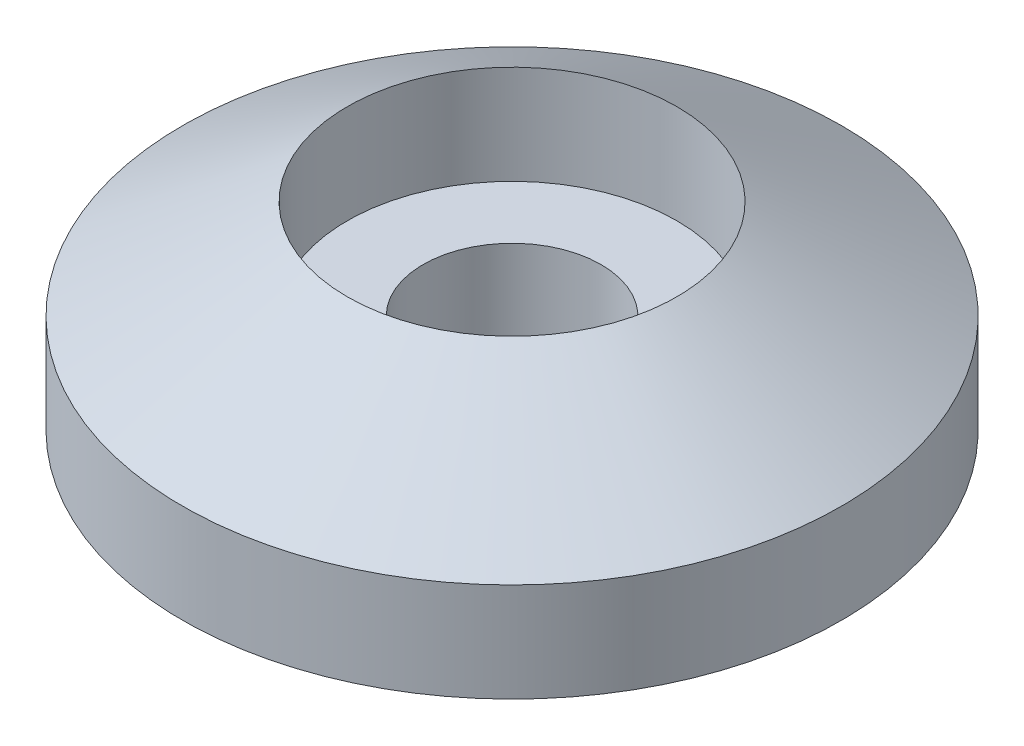
ISO-10303-21;
HEADER;
FILE_DESCRIPTION(('STEP AP214'),'2;1');
FILE_NAME('part.step','',(''),(''),'','','');
FILE_SCHEMA(('AUTOMOTIVE_DESIGN { 1 0 10303 214 1 1 1 1 }'));
ENDSEC;
DATA;
#1=APPLICATION_CONTEXT('core data for automotive mechanical design processes');
#2=APPLICATION_PROTOCOL_DEFINITION('international standard','automotive_design',2000,#1);
#3=PRODUCT_CONTEXT('',#1,'mechanical');
#4=PRODUCT('Part','Part','',(#3));
#5=PRODUCT_RELATED_PRODUCT_CATEGORY('part','',(#4));
#6=PRODUCT_DEFINITION_FORMATION('','',#4);
#7=PRODUCT_DEFINITION_CONTEXT('part definition',#1,'design');
#8=PRODUCT_DEFINITION('design','',#6,#7);
#9=PRODUCT_DEFINITION_SHAPE('','',#8);
#10=(LENGTH_UNIT() NAMED_UNIT(*) SI_UNIT(.MILLI.,.METRE.));
#11=(NAMED_UNIT(*) PLANE_ANGLE_UNIT() SI_UNIT($,.RADIAN.));
#12=(NAMED_UNIT(*) SI_UNIT($,.STERADIAN.) SOLID_ANGLE_UNIT());
#13=UNCERTAINTY_MEASURE_WITH_UNIT(LENGTH_MEASURE(1.E-05),#10,'distance_accuracy_value','');
#14=(GEOMETRIC_REPRESENTATION_CONTEXT(3) GLOBAL_UNCERTAINTY_ASSIGNED_CONTEXT((#13)) GLOBAL_UNIT_ASSIGNED_CONTEXT((#10,
#11,#12)) REPRESENTATION_CONTEXT('',''));
#15=CARTESIAN_POINT('',(0.,0.,0.));
#16=DIRECTION('',(0.,0.,1.));
#17=DIRECTION('',(1.,0.,0.));
#18=AXIS2_PLACEMENT_3D('',#15,#16,#17);
#19=CARTESIAN_POINT('',(0.,0.,0.));
#20=DIRECTION('',(0.,-1.,0.));
#21=DIRECTION('',(0.,0.,-1.));
#22=AXIS2_PLACEMENT_3D('',#19,#20,#21);
#23=CYLINDRICAL_SURFACE('',#22,2.7);
#24=CARTESIAN_POINT('',(0.,3.,0.));
#25=DIRECTION('',(0.,-1.,0.));
#26=DIRECTION('',(0.,0.,-1.));
#27=AXIS2_PLACEMENT_3D('',#24,#25,#26);
#28=CIRCLE('',#27,2.7);
#29=CARTESIAN_POINT('',(0.,3.,-2.7));
#30=VERTEX_POINT('',#29);
#31=EDGE_CURVE('E10',#30,#30,#28,.T.);
#32=ORIENTED_EDGE('',*,*,#31,.F.);
#33=EDGE_LOOP('',(#32));
#34=FACE_BOUND('',#33,.T.);
#35=CARTESIAN_POINT('',(0.,0.,0.));
#36=DIRECTION('',(0.,-1.,0.));
#37=DIRECTION('',(0.,0.,-1.));
#38=AXIS2_PLACEMENT_3D('',#35,#36,#37);
#39=CIRCLE('',#38,2.7);
#40=CARTESIAN_POINT('',(0.,0.,-2.7));
#41=VERTEX_POINT('',#40);
#42=EDGE_CURVE('E61',#41,#41,#39,.T.);
#43=ORIENTED_EDGE('',*,*,#42,.T.);
#44=EDGE_LOOP('',(#43));
#45=FACE_BOUND('',#44,.T.);
#46=ADVANCED_FACE('F39',(#34,#45),#23,.F.);
#47=CARTESIAN_POINT('',(-5.,3.,0.));
#48=DIRECTION('',(0.,-1.,0.));
#49=DIRECTION('',(0.,0.,-1.));
#50=AXIS2_PLACEMENT_3D('',#47,#48,#49);
#51=PLANE('',#50);
#52=CARTESIAN_POINT('',(0.,3.,0.));
#53=DIRECTION('',(0.,-1.,0.));
#54=DIRECTION('',(0.,0.,-1.));
#55=AXIS2_PLACEMENT_3D('',#52,#53,#54);
#56=CIRCLE('',#55,5.);
#57=CARTESIAN_POINT('',(0.,3.,-5.));
#58=VERTEX_POINT('',#57);
#59=EDGE_CURVE('E45',#58,#58,#56,.T.);
#60=ORIENTED_EDGE('',*,*,#59,.F.);
#61=EDGE_LOOP('',(#60));
#62=FACE_BOUND('',#61,.T.);
#63=ORIENTED_EDGE('',*,*,#31,.T.);
#64=EDGE_LOOP('',(#63));
#65=FACE_BOUND('',#64,.T.);
#66=ADVANCED_FACE('F86',(#62,#65),#51,.F.);
#67=CARTESIAN_POINT('',(0.,0.,0.));
#68=DIRECTION('',(0.,-1.,0.));
#69=DIRECTION('',(0.,0.,-1.));
#70=AXIS2_PLACEMENT_3D('',#67,#68,#69);
#71=CYLINDRICAL_SURFACE('',#70,5.);
#72=CARTESIAN_POINT('',(0.,6.,0.));
#73=DIRECTION('',(0.,-1.,0.));
#74=DIRECTION('',(0.,0.,-1.));
#75=AXIS2_PLACEMENT_3D('',#72,#73,#74);
#76=CIRCLE('',#75,5.);
#77=CARTESIAN_POINT('',(0.,6.,-5.));
#78=VERTEX_POINT('',#77);
#79=EDGE_CURVE('E49',#78,#78,#76,.T.);
#80=ORIENTED_EDGE('',*,*,#79,.F.);
#81=EDGE_LOOP('',(#80));
#82=FACE_BOUND('',#81,.T.);
#83=ORIENTED_EDGE('',*,*,#59,.T.);
#84=EDGE_LOOP('',(#83));
#85=FACE_BOUND('',#84,.T.);
#86=ADVANCED_FACE('F81',(#82,#85),#71,.F.);
#87=CARTESIAN_POINT('',(0.,6.,0.));
#88=DIRECTION('',(0.,-1.,0.));
#89=DIRECTION('',(0.,0.,-1.));
#90=AXIS2_PLACEMENT_3D('',#87,#88,#89);
#91=CONICAL_SURFACE('',#90,5.,1.03037682652431);
#92=CARTESIAN_POINT('',(0.,3.,0.));
#93=DIRECTION('',(0.,-1.,0.));
#94=DIRECTION('',(0.,0.,-1.));
#95=AXIS2_PLACEMENT_3D('',#92,#93,#94);
#96=CIRCLE('',#95,10.);
#97=CARTESIAN_POINT('',(0.,3.,-10.));
#98=VERTEX_POINT('',#97);
#99=EDGE_CURVE('E53',#98,#98,#96,.T.);
#100=ORIENTED_EDGE('',*,*,#99,.F.);
#101=EDGE_LOOP('',(#100));
#102=FACE_BOUND('',#101,.T.);
#103=ORIENTED_EDGE('',*,*,#79,.T.);
#104=EDGE_LOOP('',(#103));
#105=FACE_BOUND('',#104,.T.);
#106=ADVANCED_FACE('F75',(#102,#105),#91,.T.);
#107=CARTESIAN_POINT('',(0.,0.,0.));
#108=DIRECTION('',(0.,-1.,0.));
#109=DIRECTION('',(0.,0.,-1.));
#110=AXIS2_PLACEMENT_3D('',#107,#108,#109);
#111=CYLINDRICAL_SURFACE('',#110,10.);
#112=CARTESIAN_POINT('',(0.,0.,0.));
#113=DIRECTION('',(0.,-1.,0.));
#114=DIRECTION('',(0.,0.,-1.));
#115=AXIS2_PLACEMENT_3D('',#112,#113,#114);
#116=CIRCLE('',#115,10.);
#117=CARTESIAN_POINT('',(0.,0.,-10.));
#118=VERTEX_POINT('',#117);
#119=EDGE_CURVE('E58',#118,#118,#116,.T.);
#120=ORIENTED_EDGE('',*,*,#119,.F.);
#121=EDGE_LOOP('',(#120));
#122=FACE_BOUND('',#121,.T.);
#123=ORIENTED_EDGE('',*,*,#99,.T.);
#124=EDGE_LOOP('',(#123));
#125=FACE_BOUND('',#124,.T.);
#126=ADVANCED_FACE('F69',(#122,#125),#111,.T.);
#127=CARTESIAN_POINT('',(-10.,0.,0.));
#128=DIRECTION('',(0.,1.,0.));
#129=DIRECTION('',(0.,0.,1.));
#130=AXIS2_PLACEMENT_3D('',#127,#128,#129);
#131=PLANE('',#130);
#132=ORIENTED_EDGE('',*,*,#42,.F.);
#133=EDGE_LOOP('',(#132));
#134=FACE_BOUND('',#133,.T.);
#135=ORIENTED_EDGE('',*,*,#119,.T.);
#136=EDGE_LOOP('',(#135));
#137=FACE_BOUND('',#136,.T.);
#138=ADVANCED_FACE('F66',(#134,#137),#131,.F.);
#139=CLOSED_SHELL('',(#46,#66,#86,#106,#126,#138));
#140=MANIFOLD_SOLID_BREP('B2',#139);
#141=ADVANCED_BREP_SHAPE_REPRESENTATION('',(#18,#140),#14);
#142=SHAPE_DEFINITION_REPRESENTATION(#9,#141);
ENDSEC;
END-ISO-10303-21;
